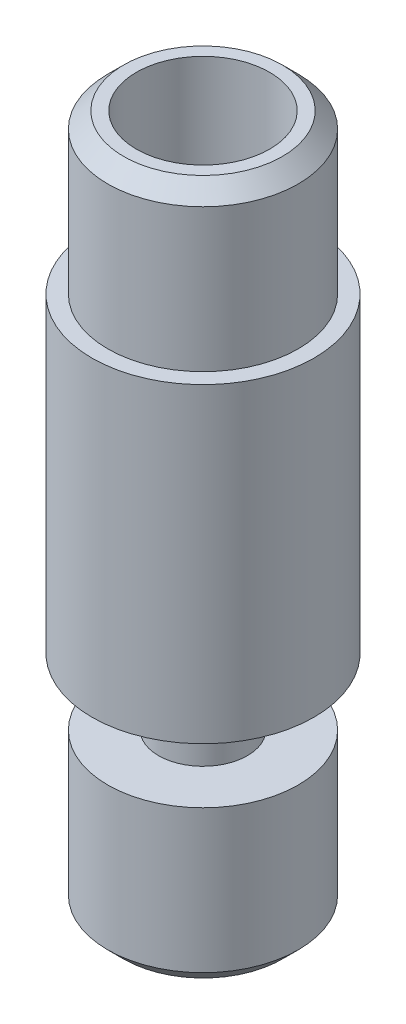
ISO-10303-21;
HEADER;
FILE_DESCRIPTION(('STEP AP214'),'2;1');
FILE_NAME('part.step','',(''),(''),'','','');
FILE_SCHEMA(('AUTOMOTIVE_DESIGN { 1 0 10303 214 1 1 1 1 }'));
ENDSEC;
DATA;
#1=APPLICATION_CONTEXT('core data for automotive mechanical design processes');
#2=APPLICATION_PROTOCOL_DEFINITION('international standard','automotive_design',2000,#1);
#3=PRODUCT_CONTEXT('',#1,'mechanical');
#4=PRODUCT('Part','Part','',(#3));
#5=PRODUCT_RELATED_PRODUCT_CATEGORY('part','',(#4));
#6=PRODUCT_DEFINITION_FORMATION('','',#4);
#7=PRODUCT_DEFINITION_CONTEXT('part definition',#1,'design');
#8=PRODUCT_DEFINITION('design','',#6,#7);
#9=PRODUCT_DEFINITION_SHAPE('','',#8);
#10=(LENGTH_UNIT() NAMED_UNIT(*) SI_UNIT(.MILLI.,.METRE.));
#11=(NAMED_UNIT(*) PLANE_ANGLE_UNIT() SI_UNIT($,.RADIAN.));
#12=(NAMED_UNIT(*) SI_UNIT($,.STERADIAN.) SOLID_ANGLE_UNIT());
#13=UNCERTAINTY_MEASURE_WITH_UNIT(LENGTH_MEASURE(1.E-05),#10,'distance_accuracy_value','');
#14=(GEOMETRIC_REPRESENTATION_CONTEXT(3) GLOBAL_UNCERTAINTY_ASSIGNED_CONTEXT((#13)) GLOBAL_UNIT_ASSIGNED_CONTEXT((#10,
#11,#12)) REPRESENTATION_CONTEXT('',''));
#15=CARTESIAN_POINT('',(0.,0.,0.));
#16=DIRECTION('',(0.,0.,1.));
#17=DIRECTION('',(1.,0.,0.));
#18=AXIS2_PLACEMENT_3D('',#15,#16,#17);
#19=CARTESIAN_POINT('',(0.,0.,0.));
#20=DIRECTION('',(0.,1.,0.));
#21=DIRECTION('',(0.,0.,1.));
#22=AXIS2_PLACEMENT_3D('',#19,#20,#21);
#23=CYLINDRICAL_SURFACE('',#22,1.);
#24=CARTESIAN_POINT('',(0.,0.,0.));
#25=DIRECTION('',(0.,1.,0.));
#26=DIRECTION('',(0.,0.,1.));
#27=AXIS2_PLACEMENT_3D('',#24,#25,#26);
#28=CIRCLE('',#27,1.);
#29=CARTESIAN_POINT('',(0.,0.,1.));
#30=VERTEX_POINT('',#29);
#31=EDGE_CURVE('E17',#30,#30,#28,.F.);
#32=ORIENTED_EDGE('',*,*,#31,.T.);
#33=EDGE_LOOP('',(#32));
#34=FACE_BOUND('',#33,.T.);
#35=CARTESIAN_POINT('',(0.,15.8000000000129,0.));
#36=DIRECTION('',(0.,1.,0.));
#37=DIRECTION('',(0.,0.,1.));
#38=AXIS2_PLACEMENT_3D('',#35,#36,#37);
#39=CIRCLE('',#38,0.99999999991951);
#40=CARTESIAN_POINT('',(0.,15.8000000000129,0.99999999991951));
#41=VERTEX_POINT('',#40);
#42=EDGE_CURVE('E29',#41,#41,#39,.T.);
#43=ORIENTED_EDGE('',*,*,#42,.T.);
#44=EDGE_LOOP('',(#43));
#45=FACE_BOUND('',#44,.T.);
#46=ADVANCED_FACE('F14',(#34,#45),#23,.F.);
#47=CARTESIAN_POINT('',(1.,0.,0.));
#48=DIRECTION('',(0.,1.,0.));
#49=DIRECTION('',(0.,0.,1.));
#50=AXIS2_PLACEMENT_3D('',#47,#48,#49);
#51=PLANE('',#50);
#52=ORIENTED_EDGE('',*,*,#31,.F.);
#53=EDGE_LOOP('',(#52));
#54=FACE_BOUND('',#53,.T.);
#55=CARTESIAN_POINT('',(0.,5.6843418860808E-11,0.));
#56=DIRECTION('',(0.,1.,0.));
#57=DIRECTION('',(0.,0.,1.));
#58=AXIS2_PLACEMENT_3D('',#55,#56,#57);
#59=CIRCLE('',#58,2.49999999999773);
#60=CARTESIAN_POINT('',(0.,5.6843418860808E-11,2.49999999999773));
#61=VERTEX_POINT('',#60);
#62=EDGE_CURVE('E50',#61,#61,#59,.T.);
#63=ORIENTED_EDGE('',*,*,#62,.F.);
#64=EDGE_LOOP('',(#63));
#65=FACE_BOUND('',#64,.T.);
#66=ADVANCED_FACE('F63',(#54,#65),#51,.F.);
#67=CARTESIAN_POINT('',(0.,16.9000000000779,0.));
#68=DIRECTION('',(0.,1.,0.));
#69=DIRECTION('',(0.,0.,1.));
#70=AXIS2_PLACEMENT_3D('',#67,#68,#69);
#71=CONICAL_SURFACE('',#70,2.0999999999276,0.78539816337161);
#72=ORIENTED_EDGE('',*,*,#42,.F.);
#73=EDGE_LOOP('',(#72));
#74=FACE_BOUND('',#73,.T.);
#75=CARTESIAN_POINT('',(0.,16.9,0.));
#76=DIRECTION('',(0.,1.,0.));
#77=DIRECTION('',(0.,0.,1.));
#78=AXIS2_PLACEMENT_3D('',#75,#76,#77);
#79=CIRCLE('',#78,2.1);
#80=CARTESIAN_POINT('',(0.,16.9,2.1));
#81=VERTEX_POINT('',#80);
#82=EDGE_CURVE('E52',#81,#81,#79,.T.);
#83=ORIENTED_EDGE('',*,*,#82,.T.);
#84=EDGE_LOOP('',(#83));
#85=FACE_BOUND('',#84,.T.);
#86=ADVANCED_FACE('F66',(#74,#85),#71,.F.);
#87=CARTESIAN_POINT('',(0.,0.500000000101863,0.));
#88=DIRECTION('',(0.,1.,0.));
#89=DIRECTION('',(0.,0.,1.));
#90=AXIS2_PLACEMENT_3D('',#87,#88,#89);
#91=CONICAL_SURFACE('',#90,2.9999999999859,0.785398163340605);
#92=CARTESIAN_POINT('',(0.,0.499999999999998,0.));
#93=DIRECTION('',(0.,1.,0.));
#94=DIRECTION('',(0.,0.,1.));
#95=AXIS2_PLACEMENT_3D('',#92,#93,#94);
#96=CIRCLE('',#95,3.);
#97=CARTESIAN_POINT('',(0.,0.499999999999998,3.));
#98=VERTEX_POINT('',#97);
#99=EDGE_CURVE('E49',#98,#98,#96,.T.);
#100=ORIENTED_EDGE('',*,*,#99,.F.);
#101=EDGE_LOOP('',(#100));
#102=FACE_BOUND('',#101,.T.);
#103=ORIENTED_EDGE('',*,*,#62,.T.);
#104=EDGE_LOOP('',(#103));
#105=FACE_BOUND('',#104,.T.);
#106=ADVANCED_FACE('F72',(#102,#105),#91,.T.);
#107=CARTESIAN_POINT('',(0.,0.,0.));
#108=DIRECTION('',(0.,1.,0.));
#109=DIRECTION('',(0.,0.,1.));
#110=AXIS2_PLACEMENT_3D('',#107,#108,#109);
#111=CYLINDRICAL_SURFACE('',#110,2.1);
#112=ORIENTED_EDGE('',*,*,#82,.F.);
#113=EDGE_LOOP('',(#112));
#114=FACE_BOUND('',#113,.T.);
#115=CARTESIAN_POINT('',(0.,21.9,0.));
#116=DIRECTION('',(0.,1.,0.));
#117=DIRECTION('',(0.,0.,1.));
#118=AXIS2_PLACEMENT_3D('',#115,#116,#117);
#119=CIRCLE('',#118,2.1);
#120=CARTESIAN_POINT('',(0.,21.9,2.1));
#121=VERTEX_POINT('',#120);
#122=EDGE_CURVE('E47',#121,#121,#119,.T.);
#123=ORIENTED_EDGE('',*,*,#122,.T.);
#124=EDGE_LOOP('',(#123));
#125=FACE_BOUND('',#124,.T.);
#126=ADVANCED_FACE('F113',(#114,#125),#111,.F.);
#127=CARTESIAN_POINT('',(0.,0.,0.));
#128=DIRECTION('',(0.,1.,0.));
#129=DIRECTION('',(0.,0.,1.));
#130=AXIS2_PLACEMENT_3D('',#127,#128,#129);
#131=CYLINDRICAL_SURFACE('',#130,3.);
#132=CARTESIAN_POINT('',(0.,5.,0.));
#133=DIRECTION('',(0.,1.,0.));
#134=DIRECTION('',(0.,0.,1.));
#135=AXIS2_PLACEMENT_3D('',#132,#133,#134);
#136=CIRCLE('',#135,3.);
#137=CARTESIAN_POINT('',(0.,5.,3.));
#138=VERTEX_POINT('',#137);
#139=EDGE_CURVE('E44',#138,#138,#136,.F.);
#140=ORIENTED_EDGE('',*,*,#139,.T.);
#141=EDGE_LOOP('',(#140));
#142=FACE_BOUND('',#141,.T.);
#143=ORIENTED_EDGE('',*,*,#99,.T.);
#144=EDGE_LOOP('',(#143));
#145=FACE_BOUND('',#144,.T.);
#146=ADVANCED_FACE('F109',(#142,#145),#131,.T.);
#147=CARTESIAN_POINT('',(2.1,21.9,0.));
#148=DIRECTION('',(0.,-1.,0.));
#149=DIRECTION('',(0.,0.,-1.));
#150=AXIS2_PLACEMENT_3D('',#147,#148,#149);
#151=PLANE('',#150);
#152=ORIENTED_EDGE('',*,*,#122,.F.);
#153=EDGE_LOOP('',(#152));
#154=FACE_BOUND('',#153,.T.);
#155=CARTESIAN_POINT('',(0.,21.8999999999596,0.));
#156=DIRECTION('',(0.,-1.,0.));
#157=DIRECTION('',(0.,0.,-1.));
#158=AXIS2_PLACEMENT_3D('',#155,#156,#157);
#159=CIRCLE('',#158,2.49999999999773);
#160=CARTESIAN_POINT('',(0.,21.8999999999596,-2.49999999999773));
#161=VERTEX_POINT('',#160);
#162=EDGE_CURVE('E41',#161,#161,#159,.T.);
#163=ORIENTED_EDGE('',*,*,#162,.F.);
#164=EDGE_LOOP('',(#163));
#165=FACE_BOUND('',#164,.T.);
#166=ADVANCED_FACE('F105',(#154,#165),#151,.F.);
#167=CARTESIAN_POINT('',(3.,5.,0.));
#168=DIRECTION('',(0.,-1.,0.));
#169=DIRECTION('',(0.,0.,-1.));
#170=AXIS2_PLACEMENT_3D('',#167,#168,#169);
#171=PLANE('',#170);
#172=ORIENTED_EDGE('',*,*,#139,.F.);
#173=EDGE_LOOP('',(#172));
#174=FACE_BOUND('',#173,.T.);
#175=CARTESIAN_POINT('',(0.,5.,0.));
#176=DIRECTION('',(0.,1.,0.));
#177=DIRECTION('',(0.,0.,1.));
#178=AXIS2_PLACEMENT_3D('',#175,#176,#177);
#179=CIRCLE('',#178,1.4);
#180=CARTESIAN_POINT('',(0.,5.,1.4));
#181=VERTEX_POINT('',#180);
#182=EDGE_CURVE('E38',#181,#181,#179,.T.);
#183=ORIENTED_EDGE('',*,*,#182,.F.);
#184=EDGE_LOOP('',(#183));
#185=FACE_BOUND('',#184,.T.);
#186=ADVANCED_FACE('F101',(#174,#185),#171,.F.);
#187=CARTESIAN_POINT('',(0.,21.3999999999146,0.));
#188=DIRECTION('',(0.,-1.,0.));
#189=DIRECTION('',(0.,0.,-1.));
#190=AXIS2_PLACEMENT_3D('',#187,#188,#189);
#191=CONICAL_SURFACE('',#190,2.9999999999859,0.785398163340605);
#192=CARTESIAN_POINT('',(0.,21.4,0.));
#193=DIRECTION('',(0.,1.,0.));
#194=DIRECTION('',(0.,0.,1.));
#195=AXIS2_PLACEMENT_3D('',#192,#193,#194);
#196=CIRCLE('',#195,3.);
#197=CARTESIAN_POINT('',(0.,21.4,3.));
#198=VERTEX_POINT('',#197);
#199=EDGE_CURVE('E37',#198,#198,#196,.F.);
#200=ORIENTED_EDGE('',*,*,#199,.F.);
#201=EDGE_LOOP('',(#200));
#202=FACE_BOUND('',#201,.T.);
#203=ORIENTED_EDGE('',*,*,#162,.T.);
#204=EDGE_LOOP('',(#203));
#205=FACE_BOUND('',#204,.T.);
#206=ADVANCED_FACE('F97',(#202,#205),#191,.T.);
#207=CARTESIAN_POINT('',(0.,0.,0.));
#208=DIRECTION('',(0.,1.,0.));
#209=DIRECTION('',(0.,0.,1.));
#210=AXIS2_PLACEMENT_3D('',#207,#208,#209);
#211=CYLINDRICAL_SURFACE('',#210,1.4);
#212=CARTESIAN_POINT('',(0.,7.1,0.));
#213=DIRECTION('',(0.,1.,0.));
#214=DIRECTION('',(0.,0.,1.));
#215=AXIS2_PLACEMENT_3D('',#212,#213,#214);
#216=CIRCLE('',#215,1.4);
#217=CARTESIAN_POINT('',(0.,7.1,1.4));
#218=VERTEX_POINT('',#217);
#219=EDGE_CURVE('E34',#218,#218,#216,.F.);
#220=ORIENTED_EDGE('',*,*,#219,.T.);
#221=EDGE_LOOP('',(#220));
#222=FACE_BOUND('',#221,.T.);
#223=ORIENTED_EDGE('',*,*,#182,.T.);
#224=EDGE_LOOP('',(#223));
#225=FACE_BOUND('',#224,.T.);
#226=ADVANCED_FACE('F93',(#222,#225),#211,.T.);
#227=CARTESIAN_POINT('',(0.,0.,0.));
#228=DIRECTION('',(0.,1.,0.));
#229=DIRECTION('',(0.,0.,1.));
#230=AXIS2_PLACEMENT_3D('',#227,#228,#229);
#231=CYLINDRICAL_SURFACE('',#230,3.);
#232=ORIENTED_EDGE('',*,*,#199,.T.);
#233=EDGE_LOOP('',(#232));
#234=FACE_BOUND('',#233,.T.);
#235=CARTESIAN_POINT('',(0.,16.9,0.));
#236=DIRECTION('',(0.,1.,0.));
#237=DIRECTION('',(0.,0.,1.));
#238=AXIS2_PLACEMENT_3D('',#235,#236,#237);
#239=CIRCLE('',#238,3.);
#240=CARTESIAN_POINT('',(0.,16.9,3.));
#241=VERTEX_POINT('',#240);
#242=EDGE_CURVE('E26',#241,#241,#239,.T.);
#243=ORIENTED_EDGE('',*,*,#242,.T.);
#244=EDGE_LOOP('',(#243));
#245=FACE_BOUND('',#244,.T.);
#246=ADVANCED_FACE('F89',(#234,#245),#231,.T.);
#247=CARTESIAN_POINT('',(1.4,7.1,0.));
#248=DIRECTION('',(0.,1.,0.));
#249=DIRECTION('',(0.,0.,1.));
#250=AXIS2_PLACEMENT_3D('',#247,#248,#249);
#251=PLANE('',#250);
#252=ORIENTED_EDGE('',*,*,#219,.F.);
#253=EDGE_LOOP('',(#252));
#254=FACE_BOUND('',#253,.T.);
#255=CARTESIAN_POINT('',(0.,7.1,0.));
#256=DIRECTION('',(0.,1.,0.));
#257=DIRECTION('',(0.,0.,1.));
#258=AXIS2_PLACEMENT_3D('',#255,#256,#257);
#259=CIRCLE('',#258,3.5);
#260=CARTESIAN_POINT('',(0.,7.1,3.5));
#261=VERTEX_POINT('',#260);
#262=EDGE_CURVE('E21',#261,#261,#259,.T.);
#263=ORIENTED_EDGE('',*,*,#262,.F.);
#264=EDGE_LOOP('',(#263));
#265=FACE_BOUND('',#264,.T.);
#266=ADVANCED_FACE('F82',(#254,#265),#251,.F.);
#267=CARTESIAN_POINT('',(3.5,16.9,0.));
#268=DIRECTION('',(0.,-1.,0.));
#269=DIRECTION('',(0.,0.,-1.));
#270=AXIS2_PLACEMENT_3D('',#267,#268,#269);
#271=PLANE('',#270);
#272=CARTESIAN_POINT('',(0.,16.9,0.));
#273=DIRECTION('',(0.,1.,0.));
#274=DIRECTION('',(0.,0.,1.));
#275=AXIS2_PLACEMENT_3D('',#272,#273,#274);
#276=CIRCLE('',#275,3.5);
#277=CARTESIAN_POINT('',(0.,16.9,3.5));
#278=VERTEX_POINT('',#277);
#279=EDGE_CURVE('E10',#278,#278,#276,.F.);
#280=ORIENTED_EDGE('',*,*,#279,.F.);
#281=EDGE_LOOP('',(#280));
#282=FACE_BOUND('',#281,.T.);
#283=ORIENTED_EDGE('',*,*,#242,.F.);
#284=EDGE_LOOP('',(#283));
#285=FACE_BOUND('',#284,.T.);
#286=ADVANCED_FACE('F77',(#282,#285),#271,.F.);
#287=CARTESIAN_POINT('',(0.,0.,0.));
#288=DIRECTION('',(0.,1.,0.));
#289=DIRECTION('',(0.,0.,1.));
#290=AXIS2_PLACEMENT_3D('',#287,#288,#289);
#291=CYLINDRICAL_SURFACE('',#290,3.5);
#292=ORIENTED_EDGE('',*,*,#279,.T.);
#293=EDGE_LOOP('',(#292));
#294=FACE_BOUND('',#293,.T.);
#295=ORIENTED_EDGE('',*,*,#262,.T.);
#296=EDGE_LOOP('',(#295));
#297=FACE_BOUND('',#296,.T.);
#298=ADVANCED_FACE('F75',(#294,#297),#291,.T.);
#299=CLOSED_SHELL('',(#46,#66,#86,#106,#126,#146,#166,#186,#206,#226,#246,#266,#286,#298));
#300=MANIFOLD_SOLID_BREP('B1',#299);
#301=ADVANCED_BREP_SHAPE_REPRESENTATION('',(#18,#300),#14);
#302=SHAPE_DEFINITION_REPRESENTATION(#9,#301);
ENDSEC;
END-ISO-10303-21;
